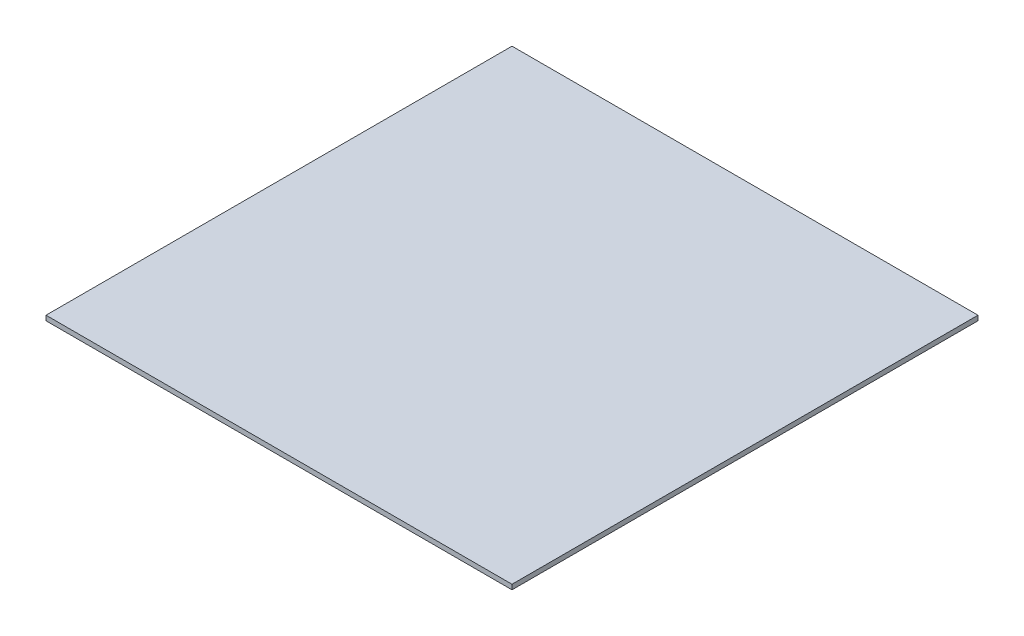
ISO-10303-21;
HEADER;
FILE_DESCRIPTION(('STEP AP214'),'2;1');
FILE_NAME('part.step','',(''),(''),'','','');
FILE_SCHEMA(('AUTOMOTIVE_DESIGN { 1 0 10303 214 1 1 1 1 }'));
ENDSEC;
DATA;
#1=APPLICATION_CONTEXT('core data for automotive mechanical design processes');
#2=APPLICATION_PROTOCOL_DEFINITION('international standard','automotive_design',2000,#1);
#3=PRODUCT_CONTEXT('',#1,'mechanical');
#4=PRODUCT('Part','Part','',(#3));
#5=PRODUCT_RELATED_PRODUCT_CATEGORY('part','',(#4));
#6=PRODUCT_DEFINITION_FORMATION('','',#4);
#7=PRODUCT_DEFINITION_CONTEXT('part definition',#1,'design');
#8=PRODUCT_DEFINITION('design','',#6,#7);
#9=PRODUCT_DEFINITION_SHAPE('','',#8);
#10=(LENGTH_UNIT() NAMED_UNIT(*) SI_UNIT(.MILLI.,.METRE.));
#11=(NAMED_UNIT(*) PLANE_ANGLE_UNIT() SI_UNIT($,.RADIAN.));
#12=(NAMED_UNIT(*) SI_UNIT($,.STERADIAN.) SOLID_ANGLE_UNIT());
#13=UNCERTAINTY_MEASURE_WITH_UNIT(LENGTH_MEASURE(1.E-05),#10,'distance_accuracy_value','');
#14=(GEOMETRIC_REPRESENTATION_CONTEXT(3) GLOBAL_UNCERTAINTY_ASSIGNED_CONTEXT((#13)) GLOBAL_UNIT_ASSIGNED_CONTEXT((#10,
#11,#12)) REPRESENTATION_CONTEXT('',''));
#15=CARTESIAN_POINT('',(0.,0.,0.));
#16=DIRECTION('',(0.,0.,1.));
#17=DIRECTION('',(1.,0.,0.));
#18=AXIS2_PLACEMENT_3D('',#15,#16,#17);
#19=CARTESIAN_POINT('',(-304.8,6.35,-304.8));
#20=DIRECTION('',(1.,0.,0.));
#21=DIRECTION('',(0.,0.,-1.));
#22=AXIS2_PLACEMENT_3D('',#19,#20,#21);
#23=PLANE('',#22);
#24=DIRECTION('',(0.,0.,1.));
#25=VECTOR('',#24,1.);
#26=CARTESIAN_POINT('',(-304.8,0.,-304.8));
#27=LINE('',#26,#25);
#28=CARTESIAN_POINT('',(-304.8,0.,-304.8));
#29=VERTEX_POINT('',#28);
#30=CARTESIAN_POINT('',(-304.8,0.,304.8));
#31=VERTEX_POINT('',#30);
#32=EDGE_CURVE('E95',#29,#31,#27,.T.);
#33=ORIENTED_EDGE('',*,*,#32,.T.);
#34=DIRECTION('',(0.,-1.,0.));
#35=VECTOR('',#34,1.);
#36=CARTESIAN_POINT('',(-304.8,6.35,304.8));
#37=LINE('',#36,#35);
#38=CARTESIAN_POINT('',(-304.8,6.35,304.8));
#39=VERTEX_POINT('',#38);
#40=EDGE_CURVE('E11',#39,#31,#37,.T.);
#41=ORIENTED_EDGE('',*,*,#40,.F.);
#42=DIRECTION('',(0.,0.,1.));
#43=VECTOR('',#42,1.);
#44=CARTESIAN_POINT('',(-304.8,6.35,-304.8));
#45=LINE('',#44,#43);
#46=CARTESIAN_POINT('',(-304.8,6.35,-304.8));
#47=VERTEX_POINT('',#46);
#48=EDGE_CURVE('E83',#47,#39,#45,.T.);
#49=ORIENTED_EDGE('',*,*,#48,.F.);
#50=DIRECTION('',(0.,-1.,0.));
#51=VECTOR('',#50,1.);
#52=CARTESIAN_POINT('',(-304.8,6.35,-304.8));
#53=LINE('',#52,#51);
#54=EDGE_CURVE('E91',#47,#29,#53,.T.);
#55=ORIENTED_EDGE('',*,*,#54,.T.);
#56=EDGE_LOOP('',(#33,#41,#49,#55));
#57=FACE_BOUND('',#56,.T.);
#58=ADVANCED_FACE('F32',(#57),#23,.F.);
#59=CARTESIAN_POINT('',(-304.8,6.35,304.8));
#60=DIRECTION('',(0.,0.,-1.));
#61=DIRECTION('',(-1.,0.,0.));
#62=AXIS2_PLACEMENT_3D('',#59,#60,#61);
#63=PLANE('',#62);
#64=DIRECTION('',(1.,0.,0.));
#65=VECTOR('',#64,1.);
#66=CARTESIAN_POINT('',(-304.8,0.,304.8));
#67=LINE('',#66,#65);
#68=CARTESIAN_POINT('',(304.8,0.,304.8));
#69=VERTEX_POINT('',#68);
#70=EDGE_CURVE('E87',#31,#69,#67,.T.);
#71=ORIENTED_EDGE('',*,*,#70,.T.);
#72=DIRECTION('',(0.,-1.,0.));
#73=VECTOR('',#72,1.);
#74=CARTESIAN_POINT('',(304.8,6.35,304.8));
#75=LINE('',#74,#73);
#76=CARTESIAN_POINT('',(304.8,6.35,304.8));
#77=VERTEX_POINT('',#76);
#78=EDGE_CURVE('E40',#77,#69,#75,.T.);
#79=ORIENTED_EDGE('',*,*,#78,.F.);
#80=DIRECTION('',(1.,0.,0.));
#81=VECTOR('',#80,1.);
#82=CARTESIAN_POINT('',(-304.8,6.35,304.8));
#83=LINE('',#82,#81);
#84=EDGE_CURVE('E78',#39,#77,#83,.T.);
#85=ORIENTED_EDGE('',*,*,#84,.F.);
#86=ORIENTED_EDGE('',*,*,#40,.T.);
#87=EDGE_LOOP('',(#71,#79,#85,#86));
#88=FACE_BOUND('',#87,.T.);
#89=ADVANCED_FACE('F86',(#88),#63,.F.);
#90=CARTESIAN_POINT('',(304.8,6.35,-304.8));
#91=DIRECTION('',(-1.,0.,0.));
#92=DIRECTION('',(0.,0.,1.));
#93=AXIS2_PLACEMENT_3D('',#90,#91,#92);
#94=PLANE('',#93);
#95=DIRECTION('',(0.,0.,-1.));
#96=VECTOR('',#95,1.);
#97=CARTESIAN_POINT('',(304.8,0.,-304.8));
#98=LINE('',#97,#96);
#99=CARTESIAN_POINT('',(304.8,0.,-304.8));
#100=VERTEX_POINT('',#99);
#101=EDGE_CURVE('E65',#69,#100,#98,.T.);
#102=ORIENTED_EDGE('',*,*,#101,.T.);
#103=DIRECTION('',(0.,-1.,0.));
#104=VECTOR('',#103,1.);
#105=CARTESIAN_POINT('',(304.8,6.35,-304.8));
#106=LINE('',#105,#104);
#107=CARTESIAN_POINT('',(304.8,6.35,-304.8));
#108=VERTEX_POINT('',#107);
#109=EDGE_CURVE('E88',#108,#100,#106,.T.);
#110=ORIENTED_EDGE('',*,*,#109,.F.);
#111=DIRECTION('',(0.,0.,-1.));
#112=VECTOR('',#111,1.);
#113=CARTESIAN_POINT('',(304.8,6.35,-304.8));
#114=LINE('',#113,#112);
#115=EDGE_CURVE('E81',#77,#108,#114,.T.);
#116=ORIENTED_EDGE('',*,*,#115,.F.);
#117=ORIENTED_EDGE('',*,*,#78,.T.);
#118=EDGE_LOOP('',(#102,#110,#116,#117));
#119=FACE_BOUND('',#118,.T.);
#120=ADVANCED_FACE('F89',(#119),#94,.F.);
#121=CARTESIAN_POINT('',(-304.8,6.35,-304.8));
#122=DIRECTION('',(0.,0.,1.));
#123=DIRECTION('',(1.,0.,0.));
#124=AXIS2_PLACEMENT_3D('',#121,#122,#123);
#125=PLANE('',#124);
#126=DIRECTION('',(-1.,0.,0.));
#127=VECTOR('',#126,1.);
#128=CARTESIAN_POINT('',(-304.8,0.,-304.8));
#129=LINE('',#128,#127);
#130=EDGE_CURVE('E71',#100,#29,#129,.T.);
#131=ORIENTED_EDGE('',*,*,#130,.T.);
#132=ORIENTED_EDGE('',*,*,#54,.F.);
#133=DIRECTION('',(-1.,0.,0.));
#134=VECTOR('',#133,1.);
#135=CARTESIAN_POINT('',(-304.8,6.35,-304.8));
#136=LINE('',#135,#134);
#137=EDGE_CURVE('E48',#108,#47,#136,.T.);
#138=ORIENTED_EDGE('',*,*,#137,.F.);
#139=ORIENTED_EDGE('',*,*,#109,.T.);
#140=EDGE_LOOP('',(#131,#132,#138,#139));
#141=FACE_BOUND('',#140,.T.);
#142=ADVANCED_FACE('F102',(#141),#125,.F.);
#143=CARTESIAN_POINT('',(0.,6.35,0.));
#144=DIRECTION('',(0.,1.,0.));
#145=DIRECTION('',(0.,0.,1.));
#146=AXIS2_PLACEMENT_3D('',#143,#144,#145);
#147=PLANE('',#146);
#148=ORIENTED_EDGE('',*,*,#48,.T.);
#149=ORIENTED_EDGE('',*,*,#84,.T.);
#150=ORIENTED_EDGE('',*,*,#115,.T.);
#151=ORIENTED_EDGE('',*,*,#137,.T.);
#152=EDGE_LOOP('',(#148,#149,#150,#151));
#153=FACE_BOUND('',#152,.T.);
#154=ADVANCED_FACE('F79',(#153),#147,.T.);
#155=CARTESIAN_POINT('',(0.,0.,0.));
#156=DIRECTION('',(0.,1.,0.));
#157=DIRECTION('',(0.,0.,1.));
#158=AXIS2_PLACEMENT_3D('',#155,#156,#157);
#159=PLANE('',#158);
#160=ORIENTED_EDGE('',*,*,#32,.F.);
#161=ORIENTED_EDGE('',*,*,#130,.F.);
#162=ORIENTED_EDGE('',*,*,#101,.F.);
#163=ORIENTED_EDGE('',*,*,#70,.F.);
#164=EDGE_LOOP('',(#160,#161,#162,#163));
#165=FACE_BOUND('',#164,.T.);
#166=ADVANCED_FACE('F105',(#165),#159,.F.);
#167=CLOSED_SHELL('',(#58,#89,#120,#142,#154,#166));
#168=MANIFOLD_SOLID_BREP('B2',#167);
#169=ADVANCED_BREP_SHAPE_REPRESENTATION('',(#18,#168),#14);
#170=SHAPE_DEFINITION_REPRESENTATION(#9,#169);
ENDSEC;
END-ISO-10303-21;
